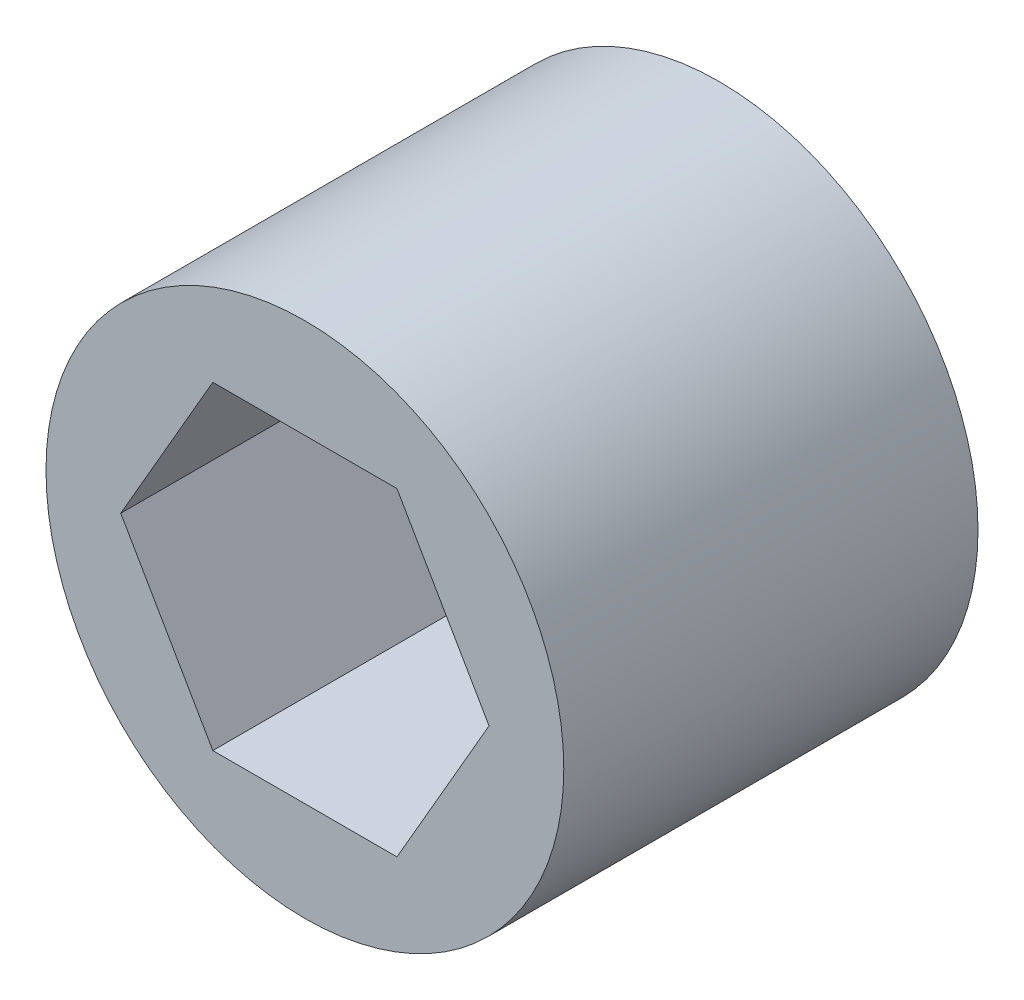
ISO-10303-21;
HEADER;
FILE_DESCRIPTION(('STEP AP214'),'2;1');
FILE_NAME('part.step','',(''),(''),'','','');
FILE_SCHEMA(('AUTOMOTIVE_DESIGN { 1 0 10303 214 1 1 1 1 }'));
ENDSEC;
DATA;
#1=APPLICATION_CONTEXT('core data for automotive mechanical design processes');
#2=APPLICATION_PROTOCOL_DEFINITION('international standard','automotive_design',2000,#1);
#3=PRODUCT_CONTEXT('',#1,'mechanical');
#4=PRODUCT('Part','Part','',(#3));
#5=PRODUCT_RELATED_PRODUCT_CATEGORY('part','',(#4));
#6=PRODUCT_DEFINITION_FORMATION('','',#4);
#7=PRODUCT_DEFINITION_CONTEXT('part definition',#1,'design');
#8=PRODUCT_DEFINITION('design','',#6,#7);
#9=PRODUCT_DEFINITION_SHAPE('','',#8);
#10=(LENGTH_UNIT() NAMED_UNIT(*) SI_UNIT(.MILLI.,.METRE.));
#11=(NAMED_UNIT(*) PLANE_ANGLE_UNIT() SI_UNIT($,.RADIAN.));
#12=(NAMED_UNIT(*) SI_UNIT($,.STERADIAN.) SOLID_ANGLE_UNIT());
#13=UNCERTAINTY_MEASURE_WITH_UNIT(LENGTH_MEASURE(1.E-05),#10,'distance_accuracy_value','');
#14=(GEOMETRIC_REPRESENTATION_CONTEXT(3) GLOBAL_UNCERTAINTY_ASSIGNED_CONTEXT((#13)) GLOBAL_UNIT_ASSIGNED_CONTEXT((#10,
#11,#12)) REPRESENTATION_CONTEXT('',''));
#15=CARTESIAN_POINT('',(0.,0.,0.));
#16=DIRECTION('',(0.,0.,1.));
#17=DIRECTION('',(1.,0.,0.));
#18=AXIS2_PLACEMENT_3D('',#15,#16,#17);
#19=CARTESIAN_POINT('',(-5.64590828240535,0.,6.35));
#20=DIRECTION('',(0.866025403784439,0.5,0.));
#21=DIRECTION('',(-0.5,0.866025403784439,0.));
#22=AXIS2_PLACEMENT_3D('',#19,#20,#21);
#23=PLANE('',#22);
#24=DIRECTION('',(-0.5,0.866025403784439,0.));
#25=VECTOR('',#24,1.);
#26=CARTESIAN_POINT('',(-2.82295414120268,-4.8895,6.35));
#27=LINE('',#26,#25);
#28=CARTESIAN_POINT('',(-2.82295414120268,-4.8895,6.35));
#29=VERTEX_POINT('',#28);
#30=CARTESIAN_POINT('',(-5.64590828240535,0.,6.35));
#31=VERTEX_POINT('',#30);
#32=EDGE_CURVE('E83',#29,#31,#27,.T.);
#33=ORIENTED_EDGE('',*,*,#32,.F.);
#34=DIRECTION('',(0.,0.,1.));
#35=VECTOR('',#34,1.);
#36=CARTESIAN_POINT('',(-2.82295414120268,-4.8895,6.35));
#37=LINE('',#36,#35);
#38=CARTESIAN_POINT('',(-2.82295414120268,-4.8895,-6.35));
#39=VERTEX_POINT('',#38);
#40=EDGE_CURVE('E75',#39,#29,#37,.T.);
#41=ORIENTED_EDGE('',*,*,#40,.F.);
#42=DIRECTION('',(-0.5,0.866025403784439,0.));
#43=VECTOR('',#42,1.);
#44=CARTESIAN_POINT('',(-2.82295414120268,-4.8895,-6.35));
#45=LINE('',#44,#43);
#46=CARTESIAN_POINT('',(-5.64590828240535,0.,-6.35));
#47=VERTEX_POINT('',#46);
#48=EDGE_CURVE('E115',#39,#47,#45,.T.);
#49=ORIENTED_EDGE('',*,*,#48,.T.);
#50=DIRECTION('',(0.,0.,1.));
#51=VECTOR('',#50,1.);
#52=CARTESIAN_POINT('',(-5.64590828240535,0.,6.35));
#53=LINE('',#52,#51);
#54=EDGE_CURVE('E100',#31,#47,#53,.F.);
#55=ORIENTED_EDGE('',*,*,#54,.F.);
#56=EDGE_LOOP('',(#33,#41,#49,#55));
#57=FACE_BOUND('',#56,.T.);
#58=ADVANCED_FACE('F16',(#57),#23,.T.);
#59=CARTESIAN_POINT('',(-2.82295414120268,4.8895,6.35));
#60=DIRECTION('',(0.866025403784439,-0.5,0.));
#61=DIRECTION('',(0.5,0.866025403784439,0.));
#62=AXIS2_PLACEMENT_3D('',#59,#60,#61);
#63=PLANE('',#62);
#64=DIRECTION('',(0.5,0.866025403784439,0.));
#65=VECTOR('',#64,1.);
#66=CARTESIAN_POINT('',(-5.64590828240535,0.,6.35));
#67=LINE('',#66,#65);
#68=CARTESIAN_POINT('',(-2.82295414120268,4.8895,6.35));
#69=VERTEX_POINT('',#68);
#70=EDGE_CURVE('E108',#31,#69,#67,.T.);
#71=ORIENTED_EDGE('',*,*,#70,.F.);
#72=ORIENTED_EDGE('',*,*,#54,.T.);
#73=DIRECTION('',(0.5,0.866025403784439,0.));
#74=VECTOR('',#73,1.);
#75=CARTESIAN_POINT('',(-5.64590828240535,0.,-6.35));
#76=LINE('',#75,#74);
#77=CARTESIAN_POINT('',(-2.82295414120268,4.8895,-6.35));
#78=VERTEX_POINT('',#77);
#79=EDGE_CURVE('E106',#47,#78,#76,.T.);
#80=ORIENTED_EDGE('',*,*,#79,.T.);
#81=DIRECTION('',(0.,0.,1.));
#82=VECTOR('',#81,1.);
#83=CARTESIAN_POINT('',(-2.82295414120268,4.8895,6.35));
#84=LINE('',#83,#82);
#85=EDGE_CURVE('E97',#69,#78,#84,.F.);
#86=ORIENTED_EDGE('',*,*,#85,.F.);
#87=EDGE_LOOP('',(#71,#72,#80,#86));
#88=FACE_BOUND('',#87,.T.);
#89=ADVANCED_FACE('F105',(#88),#63,.T.);
#90=CARTESIAN_POINT('',(2.82295414120267,4.8895,6.35));
#91=DIRECTION('',(0.,-1.,0.));
#92=DIRECTION('',(1.,0.,0.));
#93=AXIS2_PLACEMENT_3D('',#90,#91,#92);
#94=PLANE('',#93);
#95=DIRECTION('',(1.,0.,0.));
#96=VECTOR('',#95,1.);
#97=CARTESIAN_POINT('',(0.,4.8895,6.35));
#98=LINE('',#97,#96);
#99=CARTESIAN_POINT('',(2.82295414120267,4.8895,6.35));
#100=VERTEX_POINT('',#99);
#101=EDGE_CURVE('E125',#69,#100,#98,.T.);
#102=ORIENTED_EDGE('',*,*,#101,.F.);
#103=ORIENTED_EDGE('',*,*,#85,.T.);
#104=DIRECTION('',(1.,0.,0.));
#105=VECTOR('',#104,1.);
#106=CARTESIAN_POINT('',(0.,4.8895,-6.35));
#107=LINE('',#106,#105);
#108=CARTESIAN_POINT('',(2.82295414120267,4.8895,-6.35));
#109=VERTEX_POINT('',#108);
#110=EDGE_CURVE('E117',#78,#109,#107,.T.);
#111=ORIENTED_EDGE('',*,*,#110,.T.);
#112=DIRECTION('',(0.,0.,1.));
#113=VECTOR('',#112,1.);
#114=CARTESIAN_POINT('',(2.82295414120267,4.8895,6.35));
#115=LINE('',#114,#113);
#116=EDGE_CURVE('E94',#100,#109,#115,.F.);
#117=ORIENTED_EDGE('',*,*,#116,.F.);
#118=EDGE_LOOP('',(#102,#103,#111,#117));
#119=FACE_BOUND('',#118,.T.);
#120=ADVANCED_FACE('F134',(#119),#94,.T.);
#121=CARTESIAN_POINT('',(5.64590828240535,0.,6.35));
#122=DIRECTION('',(-0.866025403784438,-0.500000000000001,0.));
#123=DIRECTION('',(0.500000000000001,-0.866025403784438,0.));
#124=AXIS2_PLACEMENT_3D('',#121,#122,#123);
#125=PLANE('',#124);
#126=DIRECTION('',(0.5,-0.866025403784438,0.));
#127=VECTOR('',#126,1.);
#128=CARTESIAN_POINT('',(2.82295414120267,4.8895,6.35));
#129=LINE('',#128,#127);
#130=CARTESIAN_POINT('',(5.64590828240535,0.,6.35));
#131=VERTEX_POINT('',#130);
#132=EDGE_CURVE('E88',#100,#131,#129,.T.);
#133=ORIENTED_EDGE('',*,*,#132,.F.);
#134=ORIENTED_EDGE('',*,*,#116,.T.);
#135=DIRECTION('',(0.5,-0.866025403784438,0.));
#136=VECTOR('',#135,1.);
#137=CARTESIAN_POINT('',(2.82295414120267,4.8895,-6.35));
#138=LINE('',#137,#136);
#139=CARTESIAN_POINT('',(5.64590828240535,0.,-6.35));
#140=VERTEX_POINT('',#139);
#141=EDGE_CURVE('E119',#109,#140,#138,.T.);
#142=ORIENTED_EDGE('',*,*,#141,.T.);
#143=DIRECTION('',(0.,0.,1.));
#144=VECTOR('',#143,1.);
#145=CARTESIAN_POINT('',(5.64590828240535,0.,6.35));
#146=LINE('',#145,#144);
#147=EDGE_CURVE('E64',#131,#140,#146,.F.);
#148=ORIENTED_EDGE('',*,*,#147,.F.);
#149=EDGE_LOOP('',(#133,#134,#142,#148));
#150=FACE_BOUND('',#149,.T.);
#151=ADVANCED_FACE('F131',(#150),#125,.T.);
#152=CARTESIAN_POINT('',(2.82295414120268,-4.8895,6.35));
#153=DIRECTION('',(-0.866025403784439,0.5,0.));
#154=DIRECTION('',(-0.5,-0.866025403784439,0.));
#155=AXIS2_PLACEMENT_3D('',#152,#153,#154);
#156=PLANE('',#155);
#157=DIRECTION('',(-0.5,-0.866025403784439,0.));
#158=VECTOR('',#157,1.);
#159=CARTESIAN_POINT('',(5.64590828240535,0.,6.35));
#160=LINE('',#159,#158);
#161=CARTESIAN_POINT('',(2.82295414120268,-4.8895,6.35));
#162=VERTEX_POINT('',#161);
#163=EDGE_CURVE('E70',#131,#162,#160,.T.);
#164=ORIENTED_EDGE('',*,*,#163,.F.);
#165=ORIENTED_EDGE('',*,*,#147,.T.);
#166=DIRECTION('',(-0.5,-0.866025403784439,0.));
#167=VECTOR('',#166,1.);
#168=CARTESIAN_POINT('',(5.64590828240535,0.,-6.35));
#169=LINE('',#168,#167);
#170=CARTESIAN_POINT('',(2.82295414120268,-4.8895,-6.35));
#171=VERTEX_POINT('',#170);
#172=EDGE_CURVE('E32',#140,#171,#169,.T.);
#173=ORIENTED_EDGE('',*,*,#172,.T.);
#174=DIRECTION('',(0.,0.,1.));
#175=VECTOR('',#174,1.);
#176=CARTESIAN_POINT('',(2.82295414120268,-4.8895,6.35));
#177=LINE('',#176,#175);
#178=EDGE_CURVE('E66',#162,#171,#177,.F.);
#179=ORIENTED_EDGE('',*,*,#178,.F.);
#180=EDGE_LOOP('',(#164,#165,#173,#179));
#181=FACE_BOUND('',#180,.T.);
#182=ADVANCED_FACE('F68',(#181),#156,.T.);
#183=CARTESIAN_POINT('',(-2.82295414120268,-4.8895,6.35));
#184=DIRECTION('',(0.,1.,0.));
#185=DIRECTION('',(-1.,0.,0.));
#186=AXIS2_PLACEMENT_3D('',#183,#184,#185);
#187=PLANE('',#186);
#188=DIRECTION('',(1.,0.,0.));
#189=VECTOR('',#188,1.);
#190=CARTESIAN_POINT('',(0.,-4.8895,6.35));
#191=LINE('',#190,#189);
#192=EDGE_CURVE('E78',#162,#29,#191,.F.);
#193=ORIENTED_EDGE('',*,*,#192,.F.);
#194=ORIENTED_EDGE('',*,*,#178,.T.);
#195=DIRECTION('',(1.,0.,0.));
#196=VECTOR('',#195,1.);
#197=CARTESIAN_POINT('',(0.,-4.8895,-6.35));
#198=LINE('',#197,#196);
#199=EDGE_CURVE('E127',#171,#39,#198,.F.);
#200=ORIENTED_EDGE('',*,*,#199,.T.);
#201=ORIENTED_EDGE('',*,*,#40,.T.);
#202=EDGE_LOOP('',(#193,#194,#200,#201));
#203=FACE_BOUND('',#202,.T.);
#204=ADVANCED_FACE('F79',(#203),#187,.T.);
#205=CARTESIAN_POINT('',(0.,0.,6.35));
#206=DIRECTION('',(0.,0.,1.));
#207=DIRECTION('',(1.,0.,0.));
#208=AXIS2_PLACEMENT_3D('',#205,#206,#207);
#209=PLANE('',#208);
#210=ORIENTED_EDGE('',*,*,#101,.T.);
#211=ORIENTED_EDGE('',*,*,#132,.T.);
#212=ORIENTED_EDGE('',*,*,#163,.T.);
#213=ORIENTED_EDGE('',*,*,#192,.T.);
#214=ORIENTED_EDGE('',*,*,#32,.T.);
#215=ORIENTED_EDGE('',*,*,#70,.T.);
#216=EDGE_LOOP('',(#210,#211,#212,#213,#214,#215));
#217=FACE_BOUND('',#216,.T.);
#218=CARTESIAN_POINT('',(0.,0.,6.35));
#219=DIRECTION('',(0.,0.,-1.));
#220=DIRECTION('',(-1.,0.,0.));
#221=AXIS2_PLACEMENT_3D('',#218,#219,#220);
#222=CIRCLE('',#221,7.9375);
#223=CARTESIAN_POINT('',(-7.9375,0.,6.35));
#224=VERTEX_POINT('',#223);
#225=EDGE_CURVE('E19',#224,#224,#222,.T.);
#226=ORIENTED_EDGE('',*,*,#225,.F.);
#227=EDGE_LOOP('',(#226));
#228=FACE_BOUND('',#227,.T.);
#229=ADVANCED_FACE('F86',(#217,#228),#209,.T.);
#230=CARTESIAN_POINT('',(0.,0.,-6.35));
#231=DIRECTION('',(0.,0.,1.));
#232=DIRECTION('',(1.,0.,0.));
#233=AXIS2_PLACEMENT_3D('',#230,#231,#232);
#234=PLANE('',#233);
#235=ORIENTED_EDGE('',*,*,#172,.F.);
#236=ORIENTED_EDGE('',*,*,#141,.F.);
#237=ORIENTED_EDGE('',*,*,#110,.F.);
#238=ORIENTED_EDGE('',*,*,#79,.F.);
#239=ORIENTED_EDGE('',*,*,#48,.F.);
#240=ORIENTED_EDGE('',*,*,#199,.F.);
#241=EDGE_LOOP('',(#235,#236,#237,#238,#239,#240));
#242=FACE_BOUND('',#241,.T.);
#243=CARTESIAN_POINT('',(0.,0.,-6.35));
#244=DIRECTION('',(0.,0.,-1.));
#245=DIRECTION('',(-1.,0.,0.));
#246=AXIS2_PLACEMENT_3D('',#243,#244,#245);
#247=CIRCLE('',#246,7.9375);
#248=CARTESIAN_POINT('',(-7.9375,0.,-6.35));
#249=VERTEX_POINT('',#248);
#250=EDGE_CURVE('E10',#249,#249,#247,.F.);
#251=ORIENTED_EDGE('',*,*,#250,.F.);
#252=EDGE_LOOP('',(#251));
#253=FACE_BOUND('',#252,.T.);
#254=ADVANCED_FACE('F113',(#242,#253),#234,.F.);
#255=CARTESIAN_POINT('',(0.,0.,6.35));
#256=DIRECTION('',(0.,0.,-1.));
#257=DIRECTION('',(-1.,0.,0.));
#258=AXIS2_PLACEMENT_3D('',#255,#256,#257);
#259=CYLINDRICAL_SURFACE('',#258,7.9375);
#260=ORIENTED_EDGE('',*,*,#250,.T.);
#261=EDGE_LOOP('',(#260));
#262=FACE_BOUND('',#261,.T.);
#263=ORIENTED_EDGE('',*,*,#225,.T.);
#264=EDGE_LOOP('',(#263));
#265=FACE_BOUND('',#264,.T.);
#266=ADVANCED_FACE('F143',(#262,#265),#259,.T.);
#267=CLOSED_SHELL('',(#58,#89,#120,#151,#182,#204,#229,#254,#266));
#268=MANIFOLD_SOLID_BREP('B1',#267);
#269=ADVANCED_BREP_SHAPE_REPRESENTATION('',(#18,#268),#14);
#270=SHAPE_DEFINITION_REPRESENTATION(#9,#269);
ENDSEC;
END-ISO-10303-21;
